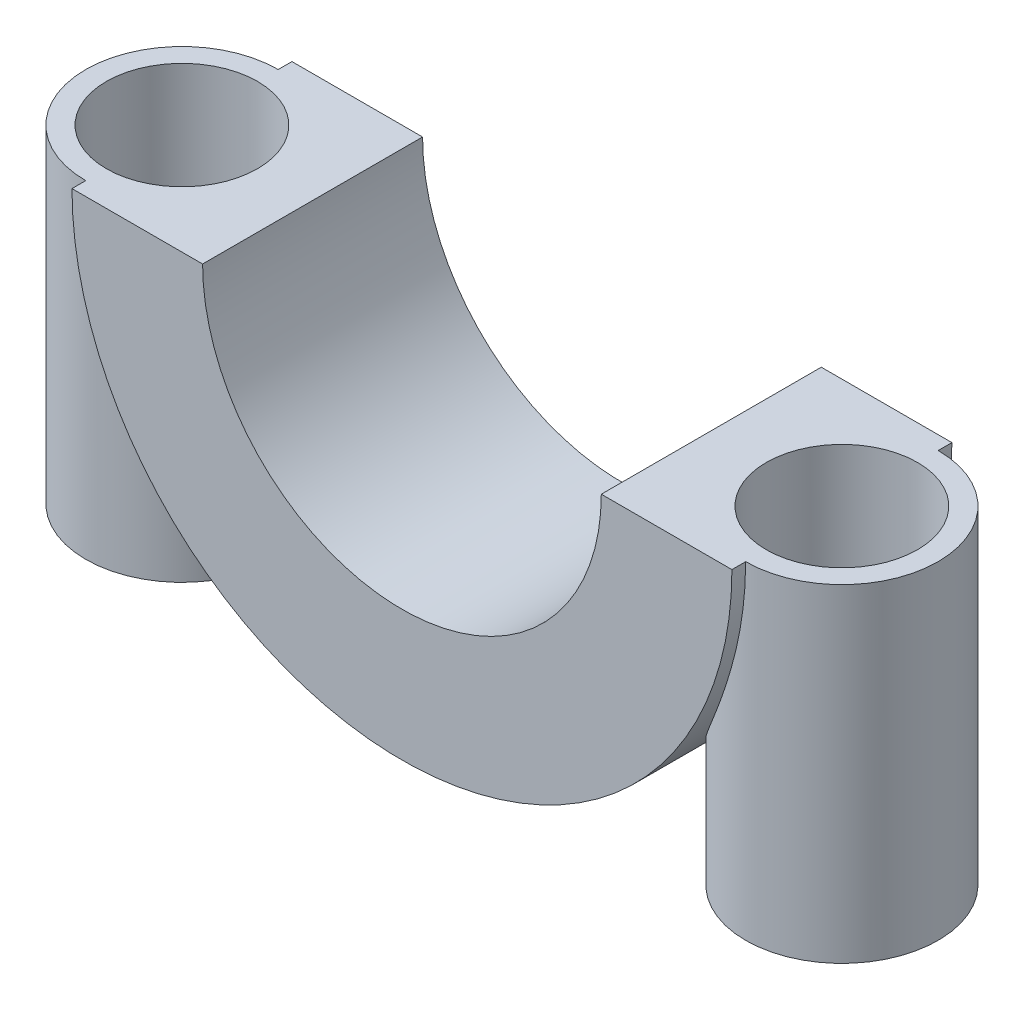
ISO-10303-21;
HEADER;
FILE_DESCRIPTION(('STEP AP214'),'2;1');
FILE_NAME('part.step','',(''),(''),'','','');
FILE_SCHEMA(('AUTOMOTIVE_DESIGN { 1 0 10303 214 1 1 1 1 }'));
ENDSEC;
DATA;
#1=APPLICATION_CONTEXT('core data for automotive mechanical design processes');
#2=APPLICATION_PROTOCOL_DEFINITION('international standard','automotive_design',2000,#1);
#3=PRODUCT_CONTEXT('',#1,'mechanical');
#4=PRODUCT('Part','Part','',(#3));
#5=PRODUCT_RELATED_PRODUCT_CATEGORY('part','',(#4));
#6=PRODUCT_DEFINITION_FORMATION('','',#4);
#7=PRODUCT_DEFINITION_CONTEXT('part definition',#1,'design');
#8=PRODUCT_DEFINITION('design','',#6,#7);
#9=PRODUCT_DEFINITION_SHAPE('','',#8);
#10=(LENGTH_UNIT() NAMED_UNIT(*) SI_UNIT(.MILLI.,.METRE.));
#11=(NAMED_UNIT(*) PLANE_ANGLE_UNIT() SI_UNIT($,.RADIAN.));
#12=(NAMED_UNIT(*) SI_UNIT($,.STERADIAN.) SOLID_ANGLE_UNIT());
#13=UNCERTAINTY_MEASURE_WITH_UNIT(LENGTH_MEASURE(1.E-05),#10,'distance_accuracy_value','');
#14=(GEOMETRIC_REPRESENTATION_CONTEXT(3) GLOBAL_UNCERTAINTY_ASSIGNED_CONTEXT((#13)) GLOBAL_UNIT_ASSIGNED_CONTEXT((#10,
#11,#12)) REPRESENTATION_CONTEXT('',''));
#15=CARTESIAN_POINT('',(0.,0.,0.));
#16=DIRECTION('',(0.,0.,1.));
#17=DIRECTION('',(1.,0.,0.));
#18=AXIS2_PLACEMENT_3D('',#15,#16,#17);
#19=CARTESIAN_POINT('',(0.,-30.64120754575,14.01));
#20=DIRECTION('',(0.,0.,-1.));
#21=DIRECTION('',(-1.,0.,0.));
#22=AXIS2_PLACEMENT_3D('',#19,#20,#21);
#23=CYLINDRICAL_SURFACE('',#22,14.5);
#24=CARTESIAN_POINT('',(0.,-30.64120754575,14.));
#25=DIRECTION('',(0.,0.,1.));
#26=DIRECTION('',(1.,0.,0.));
#27=AXIS2_PLACEMENT_3D('',#24,#25,#26);
#28=CIRCLE('',#27,14.5);
#29=CARTESIAN_POINT('',(-14.5,-30.64120754575,14.));
#30=VERTEX_POINT('',#29);
#31=CARTESIAN_POINT('',(14.5,-30.64120754575,14.));
#32=VERTEX_POINT('',#31);
#33=EDGE_CURVE('E54',#30,#32,#28,.T.);
#34=ORIENTED_EDGE('',*,*,#33,.T.);
#35=DIRECTION('',(0.,0.,-1.));
#36=VECTOR('',#35,1.);
#37=CARTESIAN_POINT('',(14.5,-30.64120754575,14.01));
#38=LINE('',#37,#36);
#39=CARTESIAN_POINT('',(14.5,-30.64120754575,-2.));
#40=VERTEX_POINT('',#39);
#41=EDGE_CURVE('E41',#32,#40,#38,.T.);
#42=ORIENTED_EDGE('',*,*,#41,.T.);
#43=CARTESIAN_POINT('',(0.,-30.64120754575,-2.));
#44=DIRECTION('',(0.,0.,1.));
#45=DIRECTION('',(1.,0.,0.));
#46=AXIS2_PLACEMENT_3D('',#43,#44,#45);
#47=CIRCLE('',#46,14.5);
#48=CARTESIAN_POINT('',(-14.5,-30.64120754575,-2.));
#49=VERTEX_POINT('',#48);
#50=EDGE_CURVE('E129',#49,#40,#47,.T.);
#51=ORIENTED_EDGE('',*,*,#50,.F.);
#52=DIRECTION('',(0.,0.,-1.));
#53=VECTOR('',#52,1.);
#54=CARTESIAN_POINT('',(-14.5,-30.64120754575,14.01));
#55=LINE('',#54,#53);
#56=EDGE_CURVE('E132',#49,#30,#55,.F.);
#57=ORIENTED_EDGE('',*,*,#56,.T.);
#58=EDGE_LOOP('',(#34,#42,#51,#57));
#59=FACE_BOUND('',#58,.T.);
#60=ADVANCED_FACE('F37',(#59),#23,.F.);
#61=CARTESIAN_POINT('',(34.3713198515824,-30.64120754575,14.01));
#62=DIRECTION('',(0.,-1.,0.));
#63=DIRECTION('',(0.,0.,-1.));
#64=AXIS2_PLACEMENT_3D('',#61,#62,#63);
#65=PLANE('',#64);
#66=CARTESIAN_POINT('',(24.,-30.64120754575,6.));
#67=DIRECTION('',(0.,-1.,0.));
#68=DIRECTION('',(0.,0.,-1.));
#69=AXIS2_PLACEMENT_3D('',#66,#67,#68);
#70=CIRCLE('',#69,5.49999999999999);
#71=CARTESIAN_POINT('',(24.,-30.64120754575,0.500000000000007));
#72=VERTEX_POINT('',#71);
#73=EDGE_CURVE('E154',#72,#72,#70,.F.);
#74=ORIENTED_EDGE('',*,*,#73,.F.);
#75=EDGE_LOOP('',(#74));
#76=FACE_BOUND('',#75,.T.);
#77=DIRECTION('',(1.,0.,0.));
#78=VECTOR('',#77,1.);
#79=CARTESIAN_POINT('',(0.,-30.64120754575,-2.));
#80=LINE('',#79,#78);
#81=CARTESIAN_POINT('',(24.,-30.64120754575,-2.));
#82=VERTEX_POINT('',#81);
#83=EDGE_CURVE('E131',#40,#82,#80,.T.);
#84=ORIENTED_EDGE('',*,*,#83,.F.);
#85=ORIENTED_EDGE('',*,*,#41,.F.);
#86=DIRECTION('',(1.,0.,0.));
#87=VECTOR('',#86,1.);
#88=CARTESIAN_POINT('',(0.,-30.64120754575,14.));
#89=LINE('',#88,#87);
#90=CARTESIAN_POINT('',(24.,-30.64120754575,14.));
#91=VERTEX_POINT('',#90);
#92=EDGE_CURVE('E105',#32,#91,#89,.T.);
#93=ORIENTED_EDGE('',*,*,#92,.T.);
#94=DIRECTION('',(0.,0.,-1.));
#95=VECTOR('',#94,1.);
#96=CARTESIAN_POINT('',(24.,-30.64120754575,12.));
#97=LINE('',#96,#95);
#98=CARTESIAN_POINT('',(24.,-30.64120754575,13.));
#99=VERTEX_POINT('',#98);
#100=EDGE_CURVE('E91',#99,#91,#97,.F.);
#101=ORIENTED_EDGE('',*,*,#100,.F.);
#102=CARTESIAN_POINT('',(24.,-30.64120754575,6.));
#103=DIRECTION('',(0.,-1.,0.));
#104=DIRECTION('',(0.,0.,-1.));
#105=AXIS2_PLACEMENT_3D('',#102,#103,#104);
#106=CIRCLE('',#105,7.);
#107=CARTESIAN_POINT('',(24.,-30.64120754575,-1.));
#108=VERTEX_POINT('',#107);
#109=EDGE_CURVE('E139',#108,#99,#106,.T.);
#110=ORIENTED_EDGE('',*,*,#109,.F.);
#111=EDGE_CURVE('E102',#82,#108,#97,.F.);
#112=ORIENTED_EDGE('',*,*,#111,.F.);
#113=EDGE_LOOP('',(#84,#85,#93,#101,#110,#112));
#114=FACE_BOUND('',#113,.T.);
#115=ADVANCED_FACE('F107',(#76,#114),#65,.F.);
#116=CARTESIAN_POINT('',(-24.,-30.64120754575,6.));
#117=DIRECTION('',(0.,-1.,0.));
#118=DIRECTION('',(0.,0.,-1.));
#119=AXIS2_PLACEMENT_3D('',#116,#117,#118);
#120=CIRCLE('',#119,5.49999999999999);
#121=CARTESIAN_POINT('',(-24.,-30.64120754575,0.500000000000007));
#122=VERTEX_POINT('',#121);
#123=EDGE_CURVE('E273',#122,#122,#120,.F.);
#124=ORIENTED_EDGE('',*,*,#123,.F.);
#125=EDGE_LOOP('',(#124));
#126=FACE_BOUND('',#125,.T.);
#127=CARTESIAN_POINT('',(-24.,-30.64120754575,6.));
#128=DIRECTION('',(0.,-1.,0.));
#129=DIRECTION('',(0.,0.,-1.));
#130=AXIS2_PLACEMENT_3D('',#127,#128,#129);
#131=CIRCLE('',#130,7.);
#132=CARTESIAN_POINT('',(-24.,-30.64120754575,13.));
#133=VERTEX_POINT('',#132);
#134=CARTESIAN_POINT('',(-24.,-30.64120754575,-1.));
#135=VERTEX_POINT('',#134);
#136=EDGE_CURVE('E141',#133,#135,#131,.T.);
#137=ORIENTED_EDGE('',*,*,#136,.F.);
#138=DIRECTION('',(0.,0.,-1.));
#139=VECTOR('',#138,1.);
#140=CARTESIAN_POINT('',(-24.,-30.64120754575,12.));
#141=LINE('',#140,#139);
#142=CARTESIAN_POINT('',(-24.,-30.64120754575,14.));
#143=VERTEX_POINT('',#142);
#144=EDGE_CURVE('E101',#143,#133,#141,.T.);
#145=ORIENTED_EDGE('',*,*,#144,.F.);
#146=DIRECTION('',(1.,0.,0.));
#147=VECTOR('',#146,1.);
#148=CARTESIAN_POINT('',(0.,-30.64120754575,14.));
#149=LINE('',#148,#147);
#150=EDGE_CURVE('E111',#143,#30,#149,.T.);
#151=ORIENTED_EDGE('',*,*,#150,.T.);
#152=ORIENTED_EDGE('',*,*,#56,.F.);
#153=DIRECTION('',(1.,0.,0.));
#154=VECTOR('',#153,1.);
#155=CARTESIAN_POINT('',(0.,-30.64120754575,-2.));
#156=LINE('',#155,#154);
#157=CARTESIAN_POINT('',(-24.,-30.64120754575,-2.));
#158=VERTEX_POINT('',#157);
#159=EDGE_CURVE('E130',#158,#49,#156,.T.);
#160=ORIENTED_EDGE('',*,*,#159,.F.);
#161=EDGE_CURVE('E148',#135,#158,#141,.T.);
#162=ORIENTED_EDGE('',*,*,#161,.F.);
#163=EDGE_LOOP('',(#137,#145,#151,#152,#160,#162));
#164=FACE_BOUND('',#163,.T.);
#165=ADVANCED_FACE('F174',(#126,#164),#65,.F.);
#166=CARTESIAN_POINT('',(0.,-30.64120754575,12.));
#167=DIRECTION('',(0.,0.,-1.));
#168=DIRECTION('',(-1.,0.,0.));
#169=AXIS2_PLACEMENT_3D('',#166,#167,#168);
#170=CYLINDRICAL_SURFACE('',#169,24.);
#171=CARTESIAN_POINT('',(0.,-30.64120754575,-2.));
#172=DIRECTION('',(0.,0.,1.));
#173=DIRECTION('',(1.,0.,0.));
#174=AXIS2_PLACEMENT_3D('',#171,#172,#173);
#175=CIRCLE('',#174,24.);
#176=EDGE_CURVE('E113',#158,#82,#175,.T.);
#177=ORIENTED_EDGE('',*,*,#176,.T.);
#178=ORIENTED_EDGE('',*,*,#111,.T.);
#179=CARTESIAN_POINT('',(20.0825462588668,-17.5,11.8011685190211));
#180=CARTESIAN_POINT('',(20.1838090285222,-17.6547326902933,11.8695322590711));
#181=CARTESIAN_POINT('',(20.2841434359577,-17.8119857498062,11.9334450195345));
#182=CARTESIAN_POINT('',(20.4824035016927,-18.1309610975356,12.0530956304875));
#183=CARTESIAN_POINT('',(20.5803301504102,-18.2926814879781,12.1088368907362));
#184=CARTESIAN_POINT('',(20.7730825428081,-18.6197672789242,12.2128057469741));
#185=CARTESIAN_POINT('',(20.8679150050699,-18.7851232668024,12.2610506160724));
#186=CARTESIAN_POINT('',(21.0543444134397,-19.1194355232479,12.3508909245197));
#187=CARTESIAN_POINT('',(21.1459409875385,-19.2883922022071,12.3924856012641));
#188=CARTESIAN_POINT('',(21.4140992164166,-19.797650889597,12.5077541767061));
#189=CARTESIAN_POINT('',(21.5854386385824,-20.1427283867717,12.5726471715979));
#190=CARTESIAN_POINT('',(21.9123916476855,-20.8434121529957,12.6836897247463));
#191=CARTESIAN_POINT('',(22.0679926114243,-21.1990265823485,12.7298243257971));
#192=CARTESIAN_POINT('',(22.3312395405578,-21.8429151541077,12.7992375270925));
#193=CARTESIAN_POINT('',(22.4420833280288,-22.1295977405616,12.8252834675664));
#194=CARTESIAN_POINT('',(22.6528503475795,-22.7075457875763,12.8699927126479));
#195=CARTESIAN_POINT('',(22.7527723897292,-22.9988117435507,12.8886552134048));
#196=CARTESIAN_POINT('',(22.9414301952106,-23.5853092246293,12.9201571280495));
#197=CARTESIAN_POINT('',(23.0301636863413,-23.8805415418051,12.9329953605001));
#198=CARTESIAN_POINT('',(23.1962235865454,-24.4743401539898,12.9542037053403));
#199=CARTESIAN_POINT('',(23.2735503477441,-24.7729063457759,12.9625739556772));
#200=CARTESIAN_POINT('',(23.4169408940144,-25.3740685140098,12.9760481746698));
#201=CARTESIAN_POINT('',(23.4829582010561,-25.6766758585523,12.9811388912851));
#202=CARTESIAN_POINT('',(23.6032370984849,-26.2842472808247,12.9890064540374));
#203=CARTESIAN_POINT('',(23.6574986180903,-26.5892113727332,12.9917832862426));
#204=CARTESIAN_POINT('',(23.7541725278581,-27.2009784718776,12.9958494355402));
#205=CARTESIAN_POINT('',(23.7965865191807,-27.5077812248935,12.9971389537126));
#206=CARTESIAN_POINT('',(23.869510176096,-28.1228000193908,12.9988786435577));
#207=CARTESIAN_POINT('',(23.9000198243448,-28.4310160629307,12.9993288140075));
#208=CARTESIAN_POINT('',(23.94984342157,-29.0578943195338,12.9998661505452));
#209=CARTESIAN_POINT('',(23.9687841756013,-29.3765862637244,12.999941726241));
#210=CARTESIAN_POINT('',(23.9939385845047,-30.0144733780465,13.0000086453643));
#211=CARTESIAN_POINT('',(24.0001521618475,-30.3336685512314,12.9999999882787));
#212=CARTESIAN_POINT('',(23.9998421635336,-30.9720867298613,13.0000000118497));
#213=CARTESIAN_POINT('',(23.9933172375803,-31.2913097346697,13.0000086943443));
#214=CARTESIAN_POINT('',(23.9675379944548,-31.9292398753218,12.9999365800906));
#215=CARTESIAN_POINT('',(23.9482837317061,-32.2479470133653,12.9998557837247));
#216=CARTESIAN_POINT('',(23.8970865924916,-32.8842133368759,12.999290249638));
#217=CARTESIAN_POINT('',(23.865148751364,-33.2017729274913,12.9988056721332));
#218=CARTESIAN_POINT('',(23.7886353677808,-33.8353671032244,12.9969127647251));
#219=CARTESIAN_POINT('',(23.7440596574363,-34.1514016680258,12.9955044225496));
#220=CARTESIAN_POINT('',(23.6423519341837,-34.7813726619326,12.9910430172269));
#221=CARTESIAN_POINT('',(23.5852224236852,-35.0953094963559,12.9879902816887));
#222=CARTESIAN_POINT('',(23.4585074850061,-35.7205979393066,12.979312518561));
#223=CARTESIAN_POINT('',(23.3889225993657,-36.0319496598203,12.9736876029957));
#224=CARTESIAN_POINT('',(23.1958056370962,-36.8217093629244,12.954658309329));
#225=CARTESIAN_POINT('',(23.0636304899686,-37.2979818602889,12.9386782912939));
#226=CARTESIAN_POINT('',(22.7703427732975,-38.2409017601391,12.8927470940162));
#227=CARTESIAN_POINT('',(22.6092273499124,-38.7075482083225,12.862794536456));
#228=CARTESIAN_POINT('',(22.2594920565395,-39.6276678570021,12.7825373295062));
#229=CARTESIAN_POINT('',(22.0709319397446,-40.0811671729494,12.7322764839591));
#230=CARTESIAN_POINT('',(21.768851571726,-40.7494693874091,12.6357422652893));
#231=CARTESIAN_POINT('',(21.6649685372772,-40.9702132683234,12.6000473453758));
#232=CARTESIAN_POINT('',(21.4511498433028,-41.4072328921988,12.5204595168979));
#233=CARTESIAN_POINT('',(21.3412150153239,-41.6235092434324,12.4765677326506));
#234=CARTESIAN_POINT('',(21.1006468425091,-42.0796419414278,12.3728436145625));
#235=CARTESIAN_POINT('',(20.9692138727685,-42.3187746020646,12.3116633743498));
#236=CARTESIAN_POINT('',(20.7001361242963,-42.7893675683151,12.1752445913314));
#237=CARTESIAN_POINT('',(20.5624930049274,-43.0208298951188,12.1000097872529));
#238=CARTESIAN_POINT('',(20.2823264412782,-43.4746914000423,11.9334182882405));
#239=CARTESIAN_POINT('',(20.1398056716831,-43.6970954033188,11.8420703184019));
#240=CARTESIAN_POINT('',(19.8515686792236,-44.1313170805939,11.6410440336142));
#241=CARTESIAN_POINT('',(19.7058532545937,-44.3431373566898,11.5313702533113));
#242=CARTESIAN_POINT('',(19.4470082486077,-44.7071860763359,11.3189762234686));
#243=CARTESIAN_POINT('',(19.3340515358191,-44.8619600327282,11.220406859874));
#244=CARTESIAN_POINT('',(19.1089919559661,-45.1629742090643,11.0101641068791));
#245=CARTESIAN_POINT('',(18.9968888685791,-45.3092167007259,10.8984942298876));
#246=CARTESIAN_POINT('',(18.7752564718695,-45.5918586643569,10.661369215572));
#247=CARTESIAN_POINT('',(18.6657245674119,-45.7282683765953,10.5359287734231));
#248=CARTESIAN_POINT('',(18.4510428397424,-45.9900724812392,10.2706169934364));
#249=CARTESIAN_POINT('',(18.345891864466,-46.115469779341,10.1307494835819));
#250=CARTESIAN_POINT('',(18.1653313260443,-46.3267244240554,9.86985426562347));
#251=CARTESIAN_POINT('',(18.0885942517193,-46.4150904595524,9.75177070518991));
#252=CARTESIAN_POINT('',(17.9401616459705,-46.5837044453988,9.50696986381735));
#253=CARTESIAN_POINT('',(17.8684649471209,-46.6639542774826,9.38025459558641));
#254=CARTESIAN_POINT('',(17.7312500042952,-46.8156702490444,9.11843225048388));
#255=CARTESIAN_POINT('',(17.6657329581165,-46.887134686467,8.98332355510392));
#256=CARTESIAN_POINT('',(17.5421074018524,-47.0205463378998,8.70531879212294));
#257=CARTESIAN_POINT('',(17.4839952346156,-47.0824982531164,8.56242661882574));
#258=CARTESIAN_POINT('',(17.3758554614853,-47.1967471402457,8.26835777050557));
#259=CARTESIAN_POINT('',(17.325897709491,-47.248961185659,8.11712299899102));
#260=CARTESIAN_POINT('',(17.2357387062571,-47.3425110565395,7.80848321882287));
#261=CARTESIAN_POINT('',(17.195537650863,-47.3838466636462,7.65107808638574));
#262=CARTESIAN_POINT('',(17.1258507148287,-47.4551221937897,7.33146843733982));
#263=CARTESIAN_POINT('',(17.0963592884985,-47.4850680150991,7.16926645184495));
#264=CARTESIAN_POINT('',(17.0487904942259,-47.5332144333395,6.84148600934338));
#265=CARTESIAN_POINT('',(17.0307115104956,-47.5514166929467,6.67590803374188));
#266=CARTESIAN_POINT('',(17.0079747264159,-47.5742820307478,6.36436676014372));
#267=CARTESIAN_POINT('',(17.0018937156596,-47.5803814181414,6.21860951706807));
#268=CARTESIAN_POINT('',(16.9988625412615,-47.5834234614358,5.92690550791167));
#269=CARTESIAN_POINT('',(17.0019119038147,-47.580366592485,5.78095875205822));
#270=CARTESIAN_POINT('',(17.0170797950866,-47.5651287456686,5.49006464686928));
#271=CARTESIAN_POINT('',(17.0291955778637,-47.552950530379,5.34511700834341));
#272=CARTESIAN_POINT('',(17.0622577699902,-47.519593424957,5.05728165681561));
#273=CARTESIAN_POINT('',(17.083204194032,-47.4984145198492,4.91439394724143));
#274=CARTESIAN_POINT('',(17.132447107807,-47.4483616797804,4.6377970984174));
#275=CARTESIAN_POINT('',(17.1603891167454,-47.4198574768875,4.50395737755416));
#276=CARTESIAN_POINT('',(17.2235358154828,-47.3550299965974,4.23989462941827));
#277=CARTESIAN_POINT('',(17.2587428354192,-47.3187042103883,4.10967277776207));
#278=CARTESIAN_POINT('',(17.3358409146599,-47.2385478478491,3.85364353734725));
#279=CARTESIAN_POINT('',(17.3777298046306,-47.1947197068944,3.72783473196705));
#280=CARTESIAN_POINT('',(17.467565366023,-47.0998962272834,3.48115901940601));
#281=CARTESIAN_POINT('',(17.5155142662889,-47.0488982508146,3.36029395226956));
#282=CARTESIAN_POINT('',(17.6746616142164,-46.8779445970667,2.98906183284328));
#283=CARTESIAN_POINT('',(17.7955883149855,-46.7457176237132,2.74833475743238));
#284=CARTESIAN_POINT('',(18.0552521741391,-46.4540475480904,2.29480363554361));
#285=CARTESIAN_POINT('',(18.1939993484025,-46.2945891238238,2.08201542898007));
#286=CARTESIAN_POINT('',(18.4475892824782,-45.9942268403015,1.73323942674743));
#287=CARTESIAN_POINT('',(18.560029119372,-45.8582555537981,1.59116558964646));
#288=CARTESIAN_POINT('',(18.7889986079915,-45.5746177068232,1.32275771803816));
#289=CARTESIAN_POINT('',(18.9055299216663,-45.4269463624793,1.19643017670298));
#290=CARTESIAN_POINT('',(19.1407072114605,-45.121213894836,0.958641946860076));
#291=CARTESIAN_POINT('',(19.2593562215172,-44.9631368170213,0.847204920779651));
#292=CARTESIAN_POINT('',(19.4968750517416,-44.638080112275,0.638388784542728));
#293=CARTESIAN_POINT('',(19.6157449318738,-44.4710975636077,0.541014327415323));
#294=CARTESIAN_POINT('',(19.9133321617839,-44.0411439268403,0.312262793118555));
#295=CARTESIAN_POINT('',(20.0912559049575,-43.773133337678,0.189293436888875));
#296=CARTESIAN_POINT('',(20.4404987041505,-43.2226414819583,-0.0309702954790676));
#297=CARTESIAN_POINT('',(20.6118141542142,-42.940152505382,-0.12825081857506));
#298=CARTESIAN_POINT('',(20.9455146766297,-42.3628458621034,-0.301229794018608));
#299=CARTESIAN_POINT('',(21.1078819689674,-42.0680055631603,-0.376886445248709));
#300=CARTESIAN_POINT('',(21.4215391732044,-41.4685852557928,-0.510035877913288));
#301=CARTESIAN_POINT('',(21.5728297212647,-41.1640058081541,-0.567529703107138));
#302=CARTESIAN_POINT('',(21.8378433150585,-40.6005229084813,-0.658913632276966));
#303=CARTESIAN_POINT('',(21.9535186310867,-40.3429092670945,-0.695171048438812));
#304=CARTESIAN_POINT('',(22.1760616201677,-39.8228356909254,-0.759190733887453));
#305=CARTESIAN_POINT('',(22.2829281463913,-39.5603751305432,-0.786951898307271));
#306=CARTESIAN_POINT('',(22.4875362343314,-39.0311566098952,-0.835459772893208));
#307=CARTESIAN_POINT('',(22.5852735861743,-38.7643967328582,-0.856203258339294));
#308=CARTESIAN_POINT('',(22.7713282339864,-38.2272090229912,-0.891976478005626));
#309=CARTESIAN_POINT('',(22.8596445043074,-37.9567807944025,-0.907005590573054));
#310=CARTESIAN_POINT('',(23.0266967453982,-37.4126384759749,-0.932519209363466));
#311=CARTESIAN_POINT('',(23.1054282754782,-37.1389229271278,-0.943001614779961));
#312=CARTESIAN_POINT('',(23.2531241724395,-36.58875692386,-0.960438604598813));
#313=CARTESIAN_POINT('',(23.3220883718837,-36.312306422642,-0.967393128529496));
#314=CARTESIAN_POINT('',(23.4501278631747,-35.7571281118496,-0.978665348559333));
#315=CARTESIAN_POINT('',(23.5092049955624,-35.4784007362849,-0.982983535826679));
#316=CARTESIAN_POINT('',(23.6173986916831,-34.919014350024,-0.989746293415279));
#317=CARTESIAN_POINT('',(23.6665157782686,-34.6383554415236,-0.992190962105618));
#318=CARTESIAN_POINT('',(23.757115199054,-34.0602219044836,-0.995939889769533));
#319=CARTESIAN_POINT('',(23.7980403386999,-33.7626593975927,-0.997175254310917));
#320=CARTESIAN_POINT('',(23.86869450796,-33.166204937302,-0.998857552794747));
#321=CARTESIAN_POINT('',(23.8984234530592,-32.8673129738839,-0.999304480785738));
#322=CARTESIAN_POINT('',(23.9466443863684,-32.268604867177,-0.999838208480321));
#323=CARTESIAN_POINT('',(23.9651356769381,-31.9687886676722,-0.999924985827496));
#324=CARTESIAN_POINT('',(23.9908523002862,-31.3686731698452,-1.00000583335882));
#325=CARTESIAN_POINT('',(23.9980776168818,-31.0683738708297,-0.999999903409799));
#326=CARTESIAN_POINT('',(24.0012552724064,-30.4671075202625,-1.00000008072185));
#327=CARTESIAN_POINT('',(23.9971847610737,-30.16614034758,-1.00000621237496));
#328=CARTESIAN_POINT('',(23.9777276686581,-29.5645733037057,-0.999971309529992));
#329=CARTESIAN_POINT('',(23.9623411291175,-29.2639734311694,-0.999930275205068));
#330=CARTESIAN_POINT('',(23.9202742642278,-28.6635730946337,-0.999577604437945));
#331=CARTESIAN_POINT('',(23.8935942619137,-28.3637726080156,-0.999265975735482));
#332=CARTESIAN_POINT('',(23.8289787967925,-27.7653890784526,-0.997984979090072));
#333=CARTESIAN_POINT('',(23.7910432890035,-27.466806040378,-0.997015608518478));
#334=CARTESIAN_POINT('',(23.6984102311806,-26.8332541957144,-0.993673265781827));
#335=CARTESIAN_POINT('',(23.6421908773733,-26.4985075349618,-0.991136875178171));
#336=CARTESIAN_POINT('',(23.5156110523899,-25.8317169222059,-0.983508108160879));
#337=CARTESIAN_POINT('',(23.4452501385329,-25.4996730551483,-0.978415651725863));
#338=CARTESIAN_POINT('',(23.2904796052538,-24.8387224201452,-0.964382515198876));
#339=CARTESIAN_POINT('',(23.2060608195283,-24.5098178480696,-0.955439318194924));
#340=CARTESIAN_POINT('',(23.0234015480126,-23.8560648446564,-0.932152139363885));
#341=CARTESIAN_POINT('',(22.9251615007825,-23.5312162849742,-0.917808328878603));
#342=CARTESIAN_POINT('',(22.7158355052703,-22.8885140670337,-0.882014328481175));
#343=CARTESIAN_POINT('',(22.6048412989291,-22.5706278922487,-0.860613046531963));
#344=CARTESIAN_POINT('',(22.3698282035818,-21.940409702528,-0.808599636804931));
#345=CARTESIAN_POINT('',(22.2458078853222,-21.6280783014797,-0.777986497593311));
#346=CARTESIAN_POINT('',(21.9854686742382,-21.0104591316902,-0.70521503830445));
#347=CARTESIAN_POINT('',(21.8491674732631,-20.7051620015818,-0.663073153698622));
#348=CARTESIAN_POINT('',(21.5649194232509,-20.1024622726678,-0.564526817743478));
#349=CARTESIAN_POINT('',(21.4169770914395,-19.8050566709551,-0.508127880088422));
#350=CARTESIAN_POINT('',(21.1720681258497,-19.3371066844233,-0.404116598790887));
#351=CARTESIAN_POINT('',(21.0784701751304,-19.163548167569,-0.362060962299352));
#352=CARTESIAN_POINT('',(20.8878574822583,-18.8202115344183,-0.271022511726794));
#353=CARTESIAN_POINT('',(20.7908436520507,-18.6504324285862,-0.222041536146022));
#354=CARTESIAN_POINT('',(20.5934019253201,-18.3144125079672,-0.116183365005759));
#355=CARTESIAN_POINT('',(20.4929622719169,-18.1481879244122,-0.0592763519690509));
#356=CARTESIAN_POINT('',(20.2895249796396,-17.820421966623,0.0631307345987475));
#357=CARTESIAN_POINT('',(20.186526116239,-17.6588829176729,0.128634988506739));
#358=CARTESIAN_POINT('',(20.0825462588668,-17.5,0.198831480978906));
#359=B_SPLINE_CURVE_WITH_KNOTS('',3,(#179,#180,#181,#182,#183,#184,#185,#186,#187,#188,#189,
#190,#191,#192,#193,#194,#195,#196,#197,#198,#199,#200,#201,#202,#203,#204,#205,#206,#207,#208,
#209,#210,#211,#212,#213,#214,#215,#216,#217,#218,#219,#220,#221,#222,#223,#224,#225,#226,#227,
#228,#229,#230,#231,#232,#233,#234,#235,#236,#237,#238,#239,#240,#241,#242,#243,#244,#245,#246,
#247,#248,#249,#250,#251,#252,#253,#254,#255,#256,#257,#258,#259,#260,#261,#262,#263,#264,#265,
#266,#267,#268,#269,#270,#271,#272,#273,#274,#275,#276,#277,#278,#279,#280,#281,#282,#283,#284,
#285,#286,#287,#288,#289,#290,#291,#292,#293,#294,#295,#296,#297,#298,#299,#300,#301,#302,#303,
#304,#305,#306,#307,#308,#309,#310,#311,#312,#313,#314,#315,#316,#317,#318,#319,#320,#321,#322,
#323,#324,#325,#326,#327,#328,#329,#330,#331,#332,#333,#334,#335,#336,#337,#338,#339,#340,#341,
#342,#343,#344,#345,#346,#347,#348,#349,#350,#351,#352,#353,#354,#355,#356,#357,#358),
.UNSPECIFIED.,.F.,.F.,(4,2,2,2,2,2,2,2,2,2,2,2,2,2,2,2,2,2,2,2,2,2,2,2,2,2,2,2,2,2,2,2,2,2,2,2,
2,2,2,2,2,2,2,2,2,2,2,2,2,2,2,2,2,2,2,2,2,2,2,2,2,2,2,2,2,2,2,2,2,2,2,2,2,2,2,2,2,2,2,2,2,2,2,2,
2,2,2,2,2,4),(0.,0.591334009348418,1.18242056339583,1.77212427225101,2.3618955564103,
3.53286044781713,4.70475719820668,5.62983712537775,6.55501774026084,7.48038594172532,
8.40572557112916,9.33478126886235,10.2638425602917,11.1927782308824,12.1217152548843,
13.0792226645591,14.0367359069887,14.9943506524755,15.9519613037743,16.909192166278,
17.8664357457993,18.823488686152,19.7804999486313,21.2629522894465,22.7455508973194,
24.2249685498713,24.9644543161779,25.7038387258442,26.542299514437,27.3805375765391,
28.2183231279195,29.0559016788885,29.7018327103623,30.3475909538792,30.9926666589402,
31.6375716420003,32.1358877168288,32.6340879913888,33.1323846341352,33.6304342143241,
34.1325486755437,34.6346732148346,35.1365373705726,35.638330455809,36.0758081089838,
36.5132630603993,36.9505855736799,37.3879088145874,37.8064415874591,38.2251088073324,
38.6436403784691,39.062326334031,39.9588754536342,40.8559306960229,41.5346143092478,
42.2135768663179,42.8936058431458,43.5738593152573,44.6053949519016,45.6374857270014,
46.6715583479836,47.7055715333136,48.5593927364498,49.4133249248103,50.267648975468,
51.1220659394013,51.9768772673199,52.831703247127,53.6863699181611,54.5409917118505,
55.4418748132851,56.342764714941,57.2437105386667,58.1446576565293,59.04742862263,
59.9501962745857,60.8529381057803,61.755683544777,62.7736988953297,63.7917461183306,
64.8104597674721,65.8291410992613,66.8409063747672,67.8527827795703,68.8632240956754,
69.8732752355027,70.4779876726211,71.0825398744458,71.6894311053249,72.2966185357651),.UNSPECIFIED.);
#360=EDGE_CURVE('E98',#99,#108,#359,.T.);
#361=ORIENTED_EDGE('',*,*,#360,.F.);
#362=ORIENTED_EDGE('',*,*,#100,.T.);
#363=CARTESIAN_POINT('',(0.,-30.64120754575,14.));
#364=DIRECTION('',(0.,0.,1.));
#365=DIRECTION('',(1.,0.,0.));
#366=AXIS2_PLACEMENT_3D('',#363,#364,#365);
#367=CIRCLE('',#366,24.);
#368=EDGE_CURVE('E96',#143,#91,#367,.T.);
#369=ORIENTED_EDGE('',*,*,#368,.F.);
#370=ORIENTED_EDGE('',*,*,#144,.T.);
#371=CARTESIAN_POINT('',(-20.0825462588668,-17.5,0.198831480978907));
#372=CARTESIAN_POINT('',(-20.1838090285222,-17.6547326902933,0.130467740928867));
#373=CARTESIAN_POINT('',(-20.2841434359577,-17.8119857498062,0.0665549804654986));
#374=CARTESIAN_POINT('',(-20.4824035016928,-18.1309610975356,-0.0530956304875305));
#375=CARTESIAN_POINT('',(-20.5803301504102,-18.2926814879781,-0.108836890736226));
#376=CARTESIAN_POINT('',(-20.7730825428082,-18.6197672789242,-0.212805746974151));
#377=CARTESIAN_POINT('',(-20.8679150050699,-18.7851232668024,-0.261050616072394));
#378=CARTESIAN_POINT('',(-21.0543444134398,-19.1194355232479,-0.350890924519723));
#379=CARTESIAN_POINT('',(-21.1459409875385,-19.2883922022071,-0.392485601264101));
#380=CARTESIAN_POINT('',(-21.4140992164166,-19.797650889597,-0.507754176706144));
#381=CARTESIAN_POINT('',(-21.5854386385824,-20.1427283867717,-0.572647171597888));
#382=CARTESIAN_POINT('',(-21.9123916476855,-20.8434121529957,-0.683689724746323));
#383=CARTESIAN_POINT('',(-22.0679926114243,-21.1990265823485,-0.729824325797118));
#384=CARTESIAN_POINT('',(-22.3312395405578,-21.8429151541077,-0.799237527092462));
#385=CARTESIAN_POINT('',(-22.4420833280288,-22.1295977405616,-0.825283467566399));
#386=CARTESIAN_POINT('',(-22.6528503475795,-22.7075457875763,-0.869992712647935));
#387=CARTESIAN_POINT('',(-22.7527723897292,-22.9988117435507,-0.888655213404827));
#388=CARTESIAN_POINT('',(-22.9414301952106,-23.5853092246293,-0.920157128049495));
#389=CARTESIAN_POINT('',(-23.0301636863413,-23.8805415418051,-0.932995360500091));
#390=CARTESIAN_POINT('',(-23.1962235865455,-24.4743401539898,-0.954203705340274));
#391=CARTESIAN_POINT('',(-23.2735503477442,-24.7729063457759,-0.962573955677188));
#392=CARTESIAN_POINT('',(-23.4169408940144,-25.3740685140098,-0.97604817466976));
#393=CARTESIAN_POINT('',(-23.4829582010562,-25.6766758585523,-0.981138891285122));
#394=CARTESIAN_POINT('',(-23.6032370984849,-26.2842472808247,-0.989006454037359));
#395=CARTESIAN_POINT('',(-23.6574986180903,-26.5892113727332,-0.991783286242604));
#396=CARTESIAN_POINT('',(-23.7541725278581,-27.2009784718776,-0.995849435540156));
#397=CARTESIAN_POINT('',(-23.7965865191807,-27.5077812248935,-0.997138953712555));
#398=CARTESIAN_POINT('',(-23.8695101760961,-28.1228000193908,-0.99887864355768));
#399=CARTESIAN_POINT('',(-23.9000198243448,-28.4310160629307,-0.999328814007518));
#400=CARTESIAN_POINT('',(-23.94984342157,-29.0578943195338,-0.999866150545167));
#401=CARTESIAN_POINT('',(-23.9687841756014,-29.3765862637244,-0.999941726240998));
#402=CARTESIAN_POINT('',(-23.9939385845047,-30.0144733780465,-1.0000086453643));
#403=CARTESIAN_POINT('',(-24.0001521618475,-30.3336685512314,-0.999999988278659));
#404=CARTESIAN_POINT('',(-23.9998421635336,-30.9720867298613,-1.00000001184967));
#405=CARTESIAN_POINT('',(-23.9933172375803,-31.2913097346697,-1.00000869434433));
#406=CARTESIAN_POINT('',(-23.9675379944549,-31.9292398753218,-0.999936580090588));
#407=CARTESIAN_POINT('',(-23.9482837317062,-32.2479470133653,-0.999855783724732));
#408=CARTESIAN_POINT('',(-23.8970865924916,-32.8842133368759,-0.999290249638009));
#409=CARTESIAN_POINT('',(-23.865148751364,-33.2017729274913,-0.998805672133166));
#410=CARTESIAN_POINT('',(-23.7886353677808,-33.8353671032244,-0.996912764725057));
#411=CARTESIAN_POINT('',(-23.7440596574363,-34.1514016680258,-0.995504422549628));
#412=CARTESIAN_POINT('',(-23.6423519341837,-34.7813726619326,-0.991043017226889));
#413=CARTESIAN_POINT('',(-23.5852224236852,-35.0953094963559,-0.987990281688679));
#414=CARTESIAN_POINT('',(-23.4585074850061,-35.7205979393066,-0.979312518560949));
#415=CARTESIAN_POINT('',(-23.3889225993658,-36.0319496598203,-0.973687602995747));
#416=CARTESIAN_POINT('',(-23.1958056370962,-36.8217093629244,-0.954658309329017));
#417=CARTESIAN_POINT('',(-23.0636304899686,-37.2979818602889,-0.938678291293944));
#418=CARTESIAN_POINT('',(-22.7703427732975,-38.2409017601391,-0.892747094016191));
#419=CARTESIAN_POINT('',(-22.6092273499124,-38.7075482083225,-0.862794536455995));
#420=CARTESIAN_POINT('',(-22.2594920565395,-39.6276678570021,-0.782537329506248));
#421=CARTESIAN_POINT('',(-22.0709319397446,-40.0811671729494,-0.732276483959102));
#422=CARTESIAN_POINT('',(-21.768851571726,-40.7494693874092,-0.635742265289283));
#423=CARTESIAN_POINT('',(-21.6649685372772,-40.9702132683234,-0.600047345375758));
#424=CARTESIAN_POINT('',(-21.4511498433028,-41.4072328921988,-0.520459516897894));
#425=CARTESIAN_POINT('',(-21.3412150153239,-41.6235092434324,-0.476567732650627));
#426=CARTESIAN_POINT('',(-21.1006468425091,-42.0796419414278,-0.372843614562488));
#427=CARTESIAN_POINT('',(-20.9692138727685,-42.3187746020646,-0.311663374349788));
#428=CARTESIAN_POINT('',(-20.7001361242963,-42.7893675683151,-0.175244591331425));
#429=CARTESIAN_POINT('',(-20.5624930049274,-43.0208298951188,-0.100009787252891));
#430=CARTESIAN_POINT('',(-20.2823264412782,-43.4746914000423,0.0665817117595096));
#431=CARTESIAN_POINT('',(-20.1398056716831,-43.6970954033188,0.157929681598132));
#432=CARTESIAN_POINT('',(-19.8515686792236,-44.1313170805939,0.358955966385803));
#433=CARTESIAN_POINT('',(-19.7058532545937,-44.3431373566898,0.468629746688682));
#434=CARTESIAN_POINT('',(-19.4470082486077,-44.7071860763358,0.68102377653143));
#435=CARTESIAN_POINT('',(-19.3340515358191,-44.8619600327282,0.779593140126014));
#436=CARTESIAN_POINT('',(-19.1089919559661,-45.1629742090643,0.989835893120901));
#437=CARTESIAN_POINT('',(-18.9968888685791,-45.3092167007259,1.10150577011241));
#438=CARTESIAN_POINT('',(-18.7752564718695,-45.5918586643569,1.33863078442795));
#439=CARTESIAN_POINT('',(-18.6657245674119,-45.7282683765953,1.46407122657688));
#440=CARTESIAN_POINT('',(-18.4510428397424,-45.9900724812392,1.72938300656365));
#441=CARTESIAN_POINT('',(-18.345891864466,-46.115469779341,1.86925051641811));
#442=CARTESIAN_POINT('',(-18.1653313260443,-46.3267244240554,2.13014573437653));
#443=CARTESIAN_POINT('',(-18.0885942517194,-46.4150904595524,2.24822929481009));
#444=CARTESIAN_POINT('',(-17.9401616459705,-46.5837044453988,2.49303013618266));
#445=CARTESIAN_POINT('',(-17.8684649471209,-46.6639542774826,2.61974540441359));
#446=CARTESIAN_POINT('',(-17.7312500042952,-46.8156702490444,2.88156774951612));
#447=CARTESIAN_POINT('',(-17.6657329581165,-46.887134686467,3.01667644489608));
#448=CARTESIAN_POINT('',(-17.5421074018524,-47.0205463378998,3.29468120787707));
#449=CARTESIAN_POINT('',(-17.4839952346156,-47.0824982531164,3.43757338117426));
#450=CARTESIAN_POINT('',(-17.3758554614853,-47.1967471402457,3.73164222949444));
#451=CARTESIAN_POINT('',(-17.325897709491,-47.248961185659,3.88287700100899));
#452=CARTESIAN_POINT('',(-17.2357387062571,-47.3425110565395,4.19151678117714));
#453=CARTESIAN_POINT('',(-17.195537650863,-47.3838466636462,4.34892191361427));
#454=CARTESIAN_POINT('',(-17.1258507148287,-47.4551221937897,4.66853156266018));
#455=CARTESIAN_POINT('',(-17.0963592884985,-47.4850680150991,4.83073354815506));
#456=CARTESIAN_POINT('',(-17.0487904942259,-47.5332144333395,5.15851399065662));
#457=CARTESIAN_POINT('',(-17.0307115104956,-47.5514166929467,5.32409196625812));
#458=CARTESIAN_POINT('',(-17.007974726416,-47.5742820307478,5.63563323985628));
#459=CARTESIAN_POINT('',(-17.0018937156596,-47.5803814181414,5.78139048293193));
#460=CARTESIAN_POINT('',(-16.9988625412616,-47.5834234614358,6.07309449208833));
#461=CARTESIAN_POINT('',(-17.0019119038148,-47.580366592485,6.21904124794178));
#462=CARTESIAN_POINT('',(-17.0170797950866,-47.5651287456686,6.50993535313072));
#463=CARTESIAN_POINT('',(-17.0291955778637,-47.552950530379,6.65488299165659));
#464=CARTESIAN_POINT('',(-17.0622577699902,-47.519593424957,6.94271834318439));
#465=CARTESIAN_POINT('',(-17.083204194032,-47.4984145198492,7.08560605275857));
#466=CARTESIAN_POINT('',(-17.132447107807,-47.4483616797804,7.3622029015826));
#467=CARTESIAN_POINT('',(-17.1603891167454,-47.4198574768875,7.49604262244585));
#468=CARTESIAN_POINT('',(-17.2235358154828,-47.3550299965974,7.76010537058173));
#469=CARTESIAN_POINT('',(-17.2587428354192,-47.3187042103883,7.89032722223793));
#470=CARTESIAN_POINT('',(-17.3358409146599,-47.2385478478491,8.14635646265275));
#471=CARTESIAN_POINT('',(-17.3777298046306,-47.1947197068944,8.27216526803295));
#472=CARTESIAN_POINT('',(-17.4675653660231,-47.0998962272834,8.51884098059399));
#473=CARTESIAN_POINT('',(-17.5155142662889,-47.0488982508146,8.63970604773044));
#474=CARTESIAN_POINT('',(-17.6746616142164,-46.8779445970667,9.01093816715671));
#475=CARTESIAN_POINT('',(-17.7955883149855,-46.7457176237132,9.25166524256762));
#476=CARTESIAN_POINT('',(-18.0552521741391,-46.4540475480904,9.70519636445639));
#477=CARTESIAN_POINT('',(-18.1939993484025,-46.2945891238238,9.91798457101993));
#478=CARTESIAN_POINT('',(-18.4475892824782,-45.9942268403016,10.2667605732526));
#479=CARTESIAN_POINT('',(-18.560029119372,-45.8582555537981,10.4088344103535));
#480=CARTESIAN_POINT('',(-18.7889986079915,-45.5746177068232,10.6772422819618));
#481=CARTESIAN_POINT('',(-18.9055299216663,-45.4269463624793,10.803569823297));
#482=CARTESIAN_POINT('',(-19.1407072114605,-45.121213894836,11.0413580531399));
#483=CARTESIAN_POINT('',(-19.2593562215172,-44.9631368170213,11.1527950792204));
#484=CARTESIAN_POINT('',(-19.4968750517416,-44.638080112275,11.3616112154573));
#485=CARTESIAN_POINT('',(-19.6157449318738,-44.4710975636077,11.4589856725847));
#486=CARTESIAN_POINT('',(-19.913332161784,-44.0411439268403,11.6877372068814));
#487=CARTESIAN_POINT('',(-20.0912559049575,-43.773133337678,11.8107065631111));
#488=CARTESIAN_POINT('',(-20.4404987041505,-43.2226414819583,12.0309702954791));
#489=CARTESIAN_POINT('',(-20.6118141542143,-42.940152505382,12.1282508185751));
#490=CARTESIAN_POINT('',(-20.9455146766297,-42.3628458621033,12.3012297940186));
#491=CARTESIAN_POINT('',(-21.1078819689674,-42.0680055631603,12.3768864452487));
#492=CARTESIAN_POINT('',(-21.4215391732044,-41.4685852557928,12.5100358779133));
#493=CARTESIAN_POINT('',(-21.5728297212647,-41.1640058081541,12.5675297031071));
#494=CARTESIAN_POINT('',(-21.8378433150585,-40.6005229084813,12.658913632277));
#495=CARTESIAN_POINT('',(-21.9535186310868,-40.3429092670945,12.6951710484388));
#496=CARTESIAN_POINT('',(-22.1760616201677,-39.8228356909254,12.7591907338875));
#497=CARTESIAN_POINT('',(-22.2829281463913,-39.5603751305431,12.7869518983073));
#498=CARTESIAN_POINT('',(-22.4875362343314,-39.0311566098952,12.8354597728932));
#499=CARTESIAN_POINT('',(-22.5852735861743,-38.7643967328582,12.8562032583393));
#500=CARTESIAN_POINT('',(-22.7713282339864,-38.2272090229912,12.8919764780056));
#501=CARTESIAN_POINT('',(-22.8596445043074,-37.9567807944025,12.9070055905731));
#502=CARTESIAN_POINT('',(-23.0266967453982,-37.4126384759749,12.9325192093635));
#503=CARTESIAN_POINT('',(-23.1054282754782,-37.1389229271278,12.94300161478));
#504=CARTESIAN_POINT('',(-23.2531241724396,-36.5887569238599,12.9604386045988));
#505=CARTESIAN_POINT('',(-23.3220883718838,-36.312306422642,12.9673931285295));
#506=CARTESIAN_POINT('',(-23.4501278631747,-35.7571281118495,12.9786653485593));
#507=CARTESIAN_POINT('',(-23.5092049955624,-35.4784007362849,12.9829835358267));
#508=CARTESIAN_POINT('',(-23.6173986916831,-34.9190143500239,12.9897462934153));
#509=CARTESIAN_POINT('',(-23.6665157782686,-34.6383554415236,12.9921909621056));
#510=CARTESIAN_POINT('',(-23.757115199054,-34.0602219044835,12.9959398897695));
#511=CARTESIAN_POINT('',(-23.7980403386999,-33.7626593975927,12.9971752543109));
#512=CARTESIAN_POINT('',(-23.8686945079601,-33.166204937302,12.9988575527947));
#513=CARTESIAN_POINT('',(-23.8984234530592,-32.8673129738839,12.9993044807857));
#514=CARTESIAN_POINT('',(-23.9466443863684,-32.268604867177,12.9998382084803));
#515=CARTESIAN_POINT('',(-23.9651356769381,-31.9687886676722,12.9999249858275));
#516=CARTESIAN_POINT('',(-23.9908523002862,-31.3686731698452,13.0000058333588));
#517=CARTESIAN_POINT('',(-23.9980776168818,-31.0683738708297,12.9999999034098));
#518=CARTESIAN_POINT('',(-24.0012552724064,-30.4671075202625,13.0000000807218));
#519=CARTESIAN_POINT('',(-23.9971847610737,-30.16614034758,13.000006212375));
#520=CARTESIAN_POINT('',(-23.9777276686581,-29.5645733037056,12.99997130953));
#521=CARTESIAN_POINT('',(-23.9623411291175,-29.2639734311694,12.9999302752051));
#522=CARTESIAN_POINT('',(-23.9202742642278,-28.6635730946336,12.9995776044379));
#523=CARTESIAN_POINT('',(-23.8935942619137,-28.3637726080155,12.9992659757355));
#524=CARTESIAN_POINT('',(-23.8289787967925,-27.7653890784526,12.9979849790901));
#525=CARTESIAN_POINT('',(-23.7910432890035,-27.466806040378,12.9970156085185));
#526=CARTESIAN_POINT('',(-23.6984102311806,-26.8332541957144,12.9936732657818));
#527=CARTESIAN_POINT('',(-23.6421908773733,-26.4985075349617,12.9911368751782));
#528=CARTESIAN_POINT('',(-23.51561105239,-25.8317169222058,12.9835081081609));
#529=CARTESIAN_POINT('',(-23.4452501385329,-25.4996730551483,12.9784156517259));
#530=CARTESIAN_POINT('',(-23.2904796052538,-24.8387224201452,12.9643825151989));
#531=CARTESIAN_POINT('',(-23.2060608195284,-24.5098178480695,12.9554393181949));
#532=CARTESIAN_POINT('',(-23.0234015480126,-23.8560648446564,12.9321521393639));
#533=CARTESIAN_POINT('',(-22.9251615007825,-23.5312162849742,12.9178083288786));
#534=CARTESIAN_POINT('',(-22.7158355052703,-22.8885140670336,12.8820143284812));
#535=CARTESIAN_POINT('',(-22.6048412989291,-22.5706278922487,12.860613046532));
#536=CARTESIAN_POINT('',(-22.3698282035818,-21.940409702528,12.8085996368049));
#537=CARTESIAN_POINT('',(-22.2458078853222,-21.6280783014797,12.7779864975933));
#538=CARTESIAN_POINT('',(-21.9854686742382,-21.0104591316902,12.7052150383044));
#539=CARTESIAN_POINT('',(-21.8491674732631,-20.7051620015817,12.6630731536986));
#540=CARTESIAN_POINT('',(-21.5649194232509,-20.1024622726677,12.5645268177435));
#541=CARTESIAN_POINT('',(-21.4169770914395,-19.8050566709551,12.5081278800884));
#542=CARTESIAN_POINT('',(-21.1720681258497,-19.3371066844233,12.4041165987909));
#543=CARTESIAN_POINT('',(-21.0784701751304,-19.163548167569,12.3620609622993));
#544=CARTESIAN_POINT('',(-20.8878574822583,-18.8202115344183,12.2710225117268));
#545=CARTESIAN_POINT('',(-20.7908436520507,-18.6504324285862,12.222041536146));
#546=CARTESIAN_POINT('',(-20.5934019253201,-18.3144125079672,12.1161833650058));
#547=CARTESIAN_POINT('',(-20.4929622719169,-18.1481879244122,12.059276351969));
#548=CARTESIAN_POINT('',(-20.2895249796396,-17.820421966623,11.9368692654012));
#549=CARTESIAN_POINT('',(-20.1865261162391,-17.6588829176729,11.8713650114933));
#550=CARTESIAN_POINT('',(-20.0825462588668,-17.5,11.8011685190211));
#551=B_SPLINE_CURVE_WITH_KNOTS('',3,(#371,#372,#373,#374,#375,#376,#377,#378,#379,#380,#381,
#382,#383,#384,#385,#386,#387,#388,#389,#390,#391,#392,#393,#394,#395,#396,#397,#398,#399,#400,
#401,#402,#403,#404,#405,#406,#407,#408,#409,#410,#411,#412,#413,#414,#415,#416,#417,#418,#419,
#420,#421,#422,#423,#424,#425,#426,#427,#428,#429,#430,#431,#432,#433,#434,#435,#436,#437,#438,
#439,#440,#441,#442,#443,#444,#445,#446,#447,#448,#449,#450,#451,#452,#453,#454,#455,#456,#457,
#458,#459,#460,#461,#462,#463,#464,#465,#466,#467,#468,#469,#470,#471,#472,#473,#474,#475,#476,
#477,#478,#479,#480,#481,#482,#483,#484,#485,#486,#487,#488,#489,#490,#491,#492,#493,#494,#495,
#496,#497,#498,#499,#500,#501,#502,#503,#504,#505,#506,#507,#508,#509,#510,#511,#512,#513,#514,
#515,#516,#517,#518,#519,#520,#521,#522,#523,#524,#525,#526,#527,#528,#529,#530,#531,#532,#533,
#534,#535,#536,#537,#538,#539,#540,#541,#542,#543,#544,#545,#546,#547,#548,#549,#550),
.UNSPECIFIED.,.F.,.F.,(4,2,2,2,2,2,2,2,2,2,2,2,2,2,2,2,2,2,2,2,2,2,2,2,2,2,2,2,2,2,2,2,2,2,2,2,
2,2,2,2,2,2,2,2,2,2,2,2,2,2,2,2,2,2,2,2,2,2,2,2,2,2,2,2,2,2,2,2,2,2,2,2,2,2,2,2,2,2,2,2,2,2,2,2,
2,2,2,2,2,4),(0.,0.59133400934842,1.18242056339583,1.77212427225101,2.3618955564103,
3.53286044781713,4.70475719820668,5.62983712537775,6.55501774026084,7.48038594172532,
8.40572557112916,9.33478126886235,10.2638425602917,11.1927782308824,12.1217152548843,
13.0792226645591,14.0367359069887,14.9943506524755,15.9519613037743,16.9091921662779,
17.8664357457993,18.823488686152,19.7804999486313,21.2629522894465,22.7455508973194,
24.2249685498713,24.9644543161779,25.7038387258443,26.542299514437,27.3805375765391,
28.2183231279195,29.0559016788884,29.7018327103623,30.3475909538791,30.9926666589401,
31.6375716420003,32.1358877168288,32.6340879913888,33.1323846341352,33.6304342143241,
34.1325486755437,34.6346732148346,35.1365373705726,35.638330455809,36.0758081089838,
36.5132630603993,36.9505855736799,37.3879088145874,37.8064415874591,38.2251088073324,
38.643640378469,39.0623263340309,39.9588754536342,40.8559306960229,41.5346143092477,
42.2135768663179,42.8936058431458,43.5738593152573,44.6053949519016,45.6374857270014,
46.6715583479836,47.7055715333136,48.5593927364499,49.4133249248104,50.267648975468,
51.1220659394013,51.9768772673199,52.831703247127,53.6863699181611,54.5409917118506,
55.4418748132851,56.342764714941,57.2437105386668,58.1446576565294,59.04742862263,
59.9501962745857,60.8529381057803,61.755683544777,62.7736988953298,63.7917461183307,
64.8104597674721,65.8291410992613,66.8409063747672,67.8527827795703,68.8632240956754,
69.8732752355027,70.4779876726211,71.0825398744458,71.6894311053249,72.2966185357651),.UNSPECIFIED.);
#552=EDGE_CURVE('E114',#135,#133,#551,.T.);
#553=ORIENTED_EDGE('',*,*,#552,.F.);
#554=ORIENTED_EDGE('',*,*,#161,.T.);
#555=EDGE_LOOP('',(#177,#178,#361,#362,#369,#370,#553,#554));
#556=FACE_BOUND('',#555,.T.);
#557=ADVANCED_FACE('F94',(#556),#170,.T.);
#558=CARTESIAN_POINT('',(0.,-30.64120754575,14.));
#559=DIRECTION('',(0.,0.,1.));
#560=DIRECTION('',(1.,0.,0.));
#561=AXIS2_PLACEMENT_3D('',#558,#559,#560);
#562=PLANE('',#561);
#563=ORIENTED_EDGE('',*,*,#92,.F.);
#564=ORIENTED_EDGE('',*,*,#33,.F.);
#565=ORIENTED_EDGE('',*,*,#150,.F.);
#566=ORIENTED_EDGE('',*,*,#368,.T.);
#567=EDGE_LOOP('',(#563,#564,#565,#566));
#568=FACE_BOUND('',#567,.T.);
#569=ADVANCED_FACE('F109',(#568),#562,.T.);
#570=CARTESIAN_POINT('',(0.,-30.64120754575,-2.));
#571=DIRECTION('',(0.,0.,1.));
#572=DIRECTION('',(1.,0.,0.));
#573=AXIS2_PLACEMENT_3D('',#570,#571,#572);
#574=PLANE('',#573);
#575=ORIENTED_EDGE('',*,*,#50,.T.);
#576=ORIENTED_EDGE('',*,*,#83,.T.);
#577=ORIENTED_EDGE('',*,*,#176,.F.);
#578=ORIENTED_EDGE('',*,*,#159,.T.);
#579=EDGE_LOOP('',(#575,#576,#577,#578));
#580=FACE_BOUND('',#579,.T.);
#581=ADVANCED_FACE('F39',(#580),#574,.F.);
#582=CARTESIAN_POINT('',(24.,-54.5,6.));
#583=DIRECTION('',(0.,1.,0.));
#584=DIRECTION('',(0.,0.,1.));
#585=AXIS2_PLACEMENT_3D('',#582,#583,#584);
#586=PLANE('',#585);
#587=CARTESIAN_POINT('',(24.,-54.5,6.));
#588=DIRECTION('',(0.,1.,0.));
#589=DIRECTION('',(0.,0.,1.));
#590=AXIS2_PLACEMENT_3D('',#587,#588,#589);
#591=CIRCLE('',#590,5.49999999999999);
#592=CARTESIAN_POINT('',(24.,-54.5,11.5));
#593=VERTEX_POINT('',#592);
#594=EDGE_CURVE('E11',#593,#593,#591,.T.);
#595=ORIENTED_EDGE('',*,*,#594,.T.);
#596=EDGE_LOOP('',(#595));
#597=FACE_BOUND('',#596,.T.);
#598=CARTESIAN_POINT('',(24.,-54.5,6.));
#599=DIRECTION('',(0.,1.,0.));
#600=DIRECTION('',(0.,0.,1.));
#601=AXIS2_PLACEMENT_3D('',#598,#599,#600);
#602=CIRCLE('',#601,7.);
#603=CARTESIAN_POINT('',(24.,-54.5,13.));
#604=VERTEX_POINT('',#603);
#605=EDGE_CURVE('E280',#604,#604,#602,.T.);
#606=ORIENTED_EDGE('',*,*,#605,.F.);
#607=EDGE_LOOP('',(#606));
#608=FACE_BOUND('',#607,.T.);
#609=ADVANCED_FACE('F172',(#597,#608),#586,.F.);
#610=CARTESIAN_POINT('',(24.,-19.5,6.));
#611=DIRECTION('',(0.,1.,0.));
#612=DIRECTION('',(0.,0.,1.));
#613=AXIS2_PLACEMENT_3D('',#610,#611,#612);
#614=CYLINDRICAL_SURFACE('',#613,5.49999999999999);
#615=ORIENTED_EDGE('',*,*,#73,.T.);
#616=EDGE_LOOP('',(#615));
#617=FACE_BOUND('',#616,.T.);
#618=ORIENTED_EDGE('',*,*,#594,.F.);
#619=EDGE_LOOP('',(#618));
#620=FACE_BOUND('',#619,.T.);
#621=ADVANCED_FACE('F162',(#617,#620),#614,.F.);
#622=CARTESIAN_POINT('',(24.,-17.5,6.));
#623=DIRECTION('',(0.,-1.,0.));
#624=DIRECTION('',(0.,0.,-1.));
#625=AXIS2_PLACEMENT_3D('',#622,#623,#624);
#626=CYLINDRICAL_SURFACE('',#625,7.);
#627=ORIENTED_EDGE('',*,*,#605,.T.);
#628=EDGE_LOOP('',(#627));
#629=FACE_BOUND('',#628,.T.);
#630=ORIENTED_EDGE('',*,*,#360,.T.);
#631=ORIENTED_EDGE('',*,*,#109,.T.);
#632=EDGE_LOOP('',(#630,#631));
#633=FACE_BOUND('',#632,.T.);
#634=ADVANCED_FACE('F157',(#629,#633),#626,.T.);
#635=CARTESIAN_POINT('',(-24.,-54.5,6.));
#636=DIRECTION('',(0.,1.,0.));
#637=DIRECTION('',(0.,0.,1.));
#638=AXIS2_PLACEMENT_3D('',#635,#636,#637);
#639=PLANE('',#638);
#640=CARTESIAN_POINT('',(-24.,-54.5,6.));
#641=DIRECTION('',(0.,1.,0.));
#642=DIRECTION('',(0.,0.,1.));
#643=AXIS2_PLACEMENT_3D('',#640,#641,#642);
#644=CIRCLE('',#643,5.49999999999999);
#645=CARTESIAN_POINT('',(-24.,-54.5,11.5));
#646=VERTEX_POINT('',#645);
#647=EDGE_CURVE('E46',#646,#646,#644,.T.);
#648=ORIENTED_EDGE('',*,*,#647,.T.);
#649=EDGE_LOOP('',(#648));
#650=FACE_BOUND('',#649,.T.);
#651=CARTESIAN_POINT('',(-24.,-54.5,6.));
#652=DIRECTION('',(0.,1.,0.));
#653=DIRECTION('',(0.,0.,1.));
#654=AXIS2_PLACEMENT_3D('',#651,#652,#653);
#655=CIRCLE('',#654,7.);
#656=CARTESIAN_POINT('',(-24.,-54.5,13.));
#657=VERTEX_POINT('',#656);
#658=EDGE_CURVE('E116',#657,#657,#655,.T.);
#659=ORIENTED_EDGE('',*,*,#658,.F.);
#660=EDGE_LOOP('',(#659));
#661=FACE_BOUND('',#660,.T.);
#662=ADVANCED_FACE('F161',(#650,#661),#639,.F.);
#663=CARTESIAN_POINT('',(-24.,-19.5,6.));
#664=DIRECTION('',(0.,1.,0.));
#665=DIRECTION('',(0.,0.,1.));
#666=AXIS2_PLACEMENT_3D('',#663,#664,#665);
#667=CYLINDRICAL_SURFACE('',#666,5.49999999999999);
#668=ORIENTED_EDGE('',*,*,#123,.T.);
#669=EDGE_LOOP('',(#668));
#670=FACE_BOUND('',#669,.T.);
#671=ORIENTED_EDGE('',*,*,#647,.F.);
#672=EDGE_LOOP('',(#671));
#673=FACE_BOUND('',#672,.T.);
#674=ADVANCED_FACE('F166',(#670,#673),#667,.F.);
#675=CARTESIAN_POINT('',(-24.,-17.5,6.));
#676=DIRECTION('',(0.,-1.,0.));
#677=DIRECTION('',(0.,0.,-1.));
#678=AXIS2_PLACEMENT_3D('',#675,#676,#677);
#679=CYLINDRICAL_SURFACE('',#678,7.);
#680=ORIENTED_EDGE('',*,*,#658,.T.);
#681=EDGE_LOOP('',(#680));
#682=FACE_BOUND('',#681,.T.);
#683=ORIENTED_EDGE('',*,*,#552,.T.);
#684=ORIENTED_EDGE('',*,*,#136,.T.);
#685=EDGE_LOOP('',(#683,#684));
#686=FACE_BOUND('',#685,.T.);
#687=ADVANCED_FACE('F164',(#682,#686),#679,.T.);
#688=CLOSED_SHELL('',(#60,#115,#165,#557,#569,#581,#609,#621,#634,#662,#674,#687));
#689=MANIFOLD_SOLID_BREP('B2',#688);
#690=ADVANCED_BREP_SHAPE_REPRESENTATION('',(#18,#689),#14);
#691=SHAPE_DEFINITION_REPRESENTATION(#9,#690);
ENDSEC;
END-ISO-10303-21;
